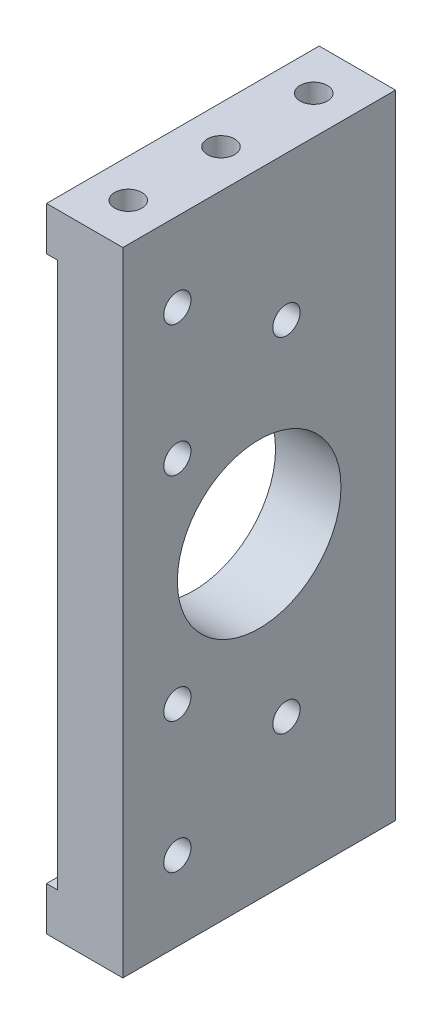
ISO-10303-21;
HEADER;
FILE_DESCRIPTION(('STEP AP214'),'2;1');
FILE_NAME('part.step','',(''),(''),'','','');
FILE_SCHEMA(('AUTOMOTIVE_DESIGN { 1 0 10303 214 1 1 1 1 }'));
ENDSEC;
DATA;
#1=APPLICATION_CONTEXT('core data for automotive mechanical design processes');
#2=APPLICATION_PROTOCOL_DEFINITION('international standard','automotive_design',2000,#1);
#3=PRODUCT_CONTEXT('',#1,'mechanical');
#4=PRODUCT('Part','Part','',(#3));
#5=PRODUCT_RELATED_PRODUCT_CATEGORY('part','',(#4));
#6=PRODUCT_DEFINITION_FORMATION('','',#4);
#7=PRODUCT_DEFINITION_CONTEXT('part definition',#1,'design');
#8=PRODUCT_DEFINITION('design','',#6,#7);
#9=PRODUCT_DEFINITION_SHAPE('','',#8);
#10=(LENGTH_UNIT() NAMED_UNIT(*) SI_UNIT(.MILLI.,.METRE.));
#11=(NAMED_UNIT(*) PLANE_ANGLE_UNIT() SI_UNIT($,.RADIAN.));
#12=(NAMED_UNIT(*) SI_UNIT($,.STERADIAN.) SOLID_ANGLE_UNIT());
#13=UNCERTAINTY_MEASURE_WITH_UNIT(LENGTH_MEASURE(1.E-05),#10,'distance_accuracy_value','');
#14=(GEOMETRIC_REPRESENTATION_CONTEXT(3) GLOBAL_UNCERTAINTY_ASSIGNED_CONTEXT((#13)) GLOBAL_UNIT_ASSIGNED_CONTEXT((#10,
#11,#12)) REPRESENTATION_CONTEXT('',''));
#15=CARTESIAN_POINT('',(0.,0.,0.));
#16=DIRECTION('',(0.,0.,1.));
#17=DIRECTION('',(1.,0.,0.));
#18=AXIS2_PLACEMENT_3D('',#15,#16,#17);
#19=CARTESIAN_POINT('',(0.,0.,25.));
#20=DIRECTION('',(0.,0.,-1.));
#21=DIRECTION('',(-1.,0.,0.));
#22=AXIS2_PLACEMENT_3D('',#19,#20,#21);
#23=PLANE('',#22);
#24=DIRECTION('',(0.,-1.,0.));
#25=VECTOR('',#24,1.);
#26=CARTESIAN_POINT('',(-86.,-29.,25.));
#27=LINE('',#26,#25);
#28=CARTESIAN_POINT('',(-86.,-25.,25.));
#29=VERTEX_POINT('',#28);
#30=CARTESIAN_POINT('',(-86.,-29.,25.));
#31=VERTEX_POINT('',#30);
#32=EDGE_CURVE('E294',#29,#31,#27,.T.);
#33=ORIENTED_EDGE('',*,*,#32,.T.);
#34=DIRECTION('',(-1.,0.,0.));
#35=VECTOR('',#34,1.);
#36=CARTESIAN_POINT('',(-79.,-29.,25.));
#37=LINE('',#36,#35);
#38=CARTESIAN_POINT('',(-79.,-29.,25.));
#39=VERTEX_POINT('',#38);
#40=EDGE_CURVE('E225',#39,#31,#37,.T.);
#41=ORIENTED_EDGE('',*,*,#40,.F.);
#42=DIRECTION('',(0.,1.,0.));
#43=VECTOR('',#42,1.);
#44=CARTESIAN_POINT('',(-79.,-29.,25.));
#45=LINE('',#44,#43);
#46=CARTESIAN_POINT('',(-79.,29.,25.));
#47=VERTEX_POINT('',#46);
#48=EDGE_CURVE('E246',#39,#47,#45,.T.);
#49=ORIENTED_EDGE('',*,*,#48,.T.);
#50=DIRECTION('',(-1.,0.,0.));
#51=VECTOR('',#50,1.);
#52=CARTESIAN_POINT('',(-86.,29.,25.));
#53=LINE('',#52,#51);
#54=CARTESIAN_POINT('',(-86.,29.,25.));
#55=VERTEX_POINT('',#54);
#56=EDGE_CURVE('E50',#47,#55,#53,.T.);
#57=ORIENTED_EDGE('',*,*,#56,.T.);
#58=CARTESIAN_POINT('',(-86.,25.,25.));
#59=VERTEX_POINT('',#58);
#60=EDGE_CURVE('E290',#55,#59,#27,.T.);
#61=ORIENTED_EDGE('',*,*,#60,.T.);
#62=DIRECTION('',(-1.,0.,0.));
#63=VECTOR('',#62,1.);
#64=CARTESIAN_POINT('',(-86.,25.,25.));
#65=LINE('',#64,#63);
#66=CARTESIAN_POINT('',(-85.,25.,25.));
#67=VERTEX_POINT('',#66);
#68=EDGE_CURVE('E260',#67,#59,#65,.T.);
#69=ORIENTED_EDGE('',*,*,#68,.F.);
#70=DIRECTION('',(0.,1.,0.));
#71=VECTOR('',#70,1.);
#72=CARTESIAN_POINT('',(-85.,25.,25.));
#73=LINE('',#72,#71);
#74=CARTESIAN_POINT('',(-85.,-25.,25.));
#75=VERTEX_POINT('',#74);
#76=EDGE_CURVE('E271',#75,#67,#73,.T.);
#77=ORIENTED_EDGE('',*,*,#76,.F.);
#78=DIRECTION('',(1.,0.,0.));
#79=VECTOR('',#78,1.);
#80=CARTESIAN_POINT('',(-86.,-25.,25.));
#81=LINE('',#80,#79);
#82=EDGE_CURVE('E253',#29,#75,#81,.T.);
#83=ORIENTED_EDGE('',*,*,#82,.F.);
#84=EDGE_LOOP('',(#33,#41,#49,#57,#61,#69,#77,#83));
#85=FACE_BOUND('',#84,.T.);
#86=ADVANCED_FACE('F40',(#85),#23,.F.);
#87=CARTESIAN_POINT('',(0.,0.,0.));
#88=DIRECTION('',(0.,0.,-1.));
#89=DIRECTION('',(-1.,0.,0.));
#90=AXIS2_PLACEMENT_3D('',#87,#88,#89);
#91=PLANE('',#90);
#92=DIRECTION('',(1.,0.,0.));
#93=VECTOR('',#92,1.);
#94=CARTESIAN_POINT('',(0.,-29.,0.));
#95=LINE('',#94,#93);
#96=CARTESIAN_POINT('',(-86.,-29.,0.));
#97=VERTEX_POINT('',#96);
#98=CARTESIAN_POINT('',(-79.,-29.,0.));
#99=VERTEX_POINT('',#98);
#100=EDGE_CURVE('E57',#97,#99,#95,.T.);
#101=ORIENTED_EDGE('',*,*,#100,.F.);
#102=DIRECTION('',(0.,-1.,0.));
#103=VECTOR('',#102,1.);
#104=CARTESIAN_POINT('',(-86.,-29.,0.));
#105=LINE('',#104,#103);
#106=CARTESIAN_POINT('',(-86.,-25.,0.));
#107=VERTEX_POINT('',#106);
#108=EDGE_CURVE('E281',#107,#97,#105,.T.);
#109=ORIENTED_EDGE('',*,*,#108,.F.);
#110=DIRECTION('',(1.,0.,0.));
#111=VECTOR('',#110,1.);
#112=CARTESIAN_POINT('',(-86.,-25.,0.));
#113=LINE('',#112,#111);
#114=CARTESIAN_POINT('',(-85.,-25.,0.));
#115=VERTEX_POINT('',#114);
#116=EDGE_CURVE('E256',#107,#115,#113,.T.);
#117=ORIENTED_EDGE('',*,*,#116,.T.);
#118=DIRECTION('',(0.,1.,0.));
#119=VECTOR('',#118,1.);
#120=CARTESIAN_POINT('',(-85.,25.,0.));
#121=LINE('',#120,#119);
#122=CARTESIAN_POINT('',(-85.,25.,0.));
#123=VERTEX_POINT('',#122);
#124=EDGE_CURVE('E65',#115,#123,#121,.T.);
#125=ORIENTED_EDGE('',*,*,#124,.T.);
#126=DIRECTION('',(-1.,0.,0.));
#127=VECTOR('',#126,1.);
#128=CARTESIAN_POINT('',(-86.,25.,0.));
#129=LINE('',#128,#127);
#130=CARTESIAN_POINT('',(-86.,25.,0.));
#131=VERTEX_POINT('',#130);
#132=EDGE_CURVE('E263',#123,#131,#129,.T.);
#133=ORIENTED_EDGE('',*,*,#132,.T.);
#134=CARTESIAN_POINT('',(-86.,29.,0.));
#135=VERTEX_POINT('',#134);
#136=EDGE_CURVE('E297',#135,#131,#105,.T.);
#137=ORIENTED_EDGE('',*,*,#136,.F.);
#138=DIRECTION('',(-1.,0.,0.));
#139=VECTOR('',#138,1.);
#140=CARTESIAN_POINT('',(-86.,29.,0.));
#141=LINE('',#140,#139);
#142=CARTESIAN_POINT('',(-79.,29.,0.));
#143=VERTEX_POINT('',#142);
#144=EDGE_CURVE('E301',#143,#135,#141,.T.);
#145=ORIENTED_EDGE('',*,*,#144,.F.);
#146=DIRECTION('',(0.,1.,0.));
#147=VECTOR('',#146,1.);
#148=CARTESIAN_POINT('',(-79.,-29.,0.));
#149=LINE('',#148,#147);
#150=EDGE_CURVE('E250',#99,#143,#149,.T.);
#151=ORIENTED_EDGE('',*,*,#150,.F.);
#152=EDGE_LOOP('',(#101,#109,#117,#125,#133,#137,#145,#151));
#153=FACE_BOUND('',#152,.T.);
#154=ADVANCED_FACE('F321',(#153),#91,.T.);
#155=CARTESIAN_POINT('',(-86.,-29.,25.));
#156=DIRECTION('',(1.,0.,0.));
#157=DIRECTION('',(0.,0.,-1.));
#158=AXIS2_PLACEMENT_3D('',#155,#156,#157);
#159=PLANE('',#158);
#160=ORIENTED_EDGE('',*,*,#136,.T.);
#161=DIRECTION('',(0.,0.,1.));
#162=VECTOR('',#161,1.);
#163=CARTESIAN_POINT('',(-86.,25.,0.));
#164=LINE('',#163,#162);
#165=EDGE_CURVE('E277',#131,#59,#164,.T.);
#166=ORIENTED_EDGE('',*,*,#165,.T.);
#167=ORIENTED_EDGE('',*,*,#60,.F.);
#168=DIRECTION('',(0.,0.,-1.));
#169=VECTOR('',#168,1.);
#170=CARTESIAN_POINT('',(-86.,29.,25.));
#171=LINE('',#170,#169);
#172=EDGE_CURVE('E11',#55,#135,#171,.T.);
#173=ORIENTED_EDGE('',*,*,#172,.T.);
#174=EDGE_LOOP('',(#160,#166,#167,#173));
#175=FACE_BOUND('',#174,.T.);
#176=ADVANCED_FACE('F331',(#175),#159,.F.);
#177=ORIENTED_EDGE('',*,*,#108,.T.);
#178=DIRECTION('',(0.,0.,1.));
#179=VECTOR('',#178,1.);
#180=CARTESIAN_POINT('',(-86.,-29.,-35.));
#181=LINE('',#180,#179);
#182=EDGE_CURVE('E228',#97,#31,#181,.T.);
#183=ORIENTED_EDGE('',*,*,#182,.T.);
#184=ORIENTED_EDGE('',*,*,#32,.F.);
#185=DIRECTION('',(0.,0.,1.));
#186=VECTOR('',#185,1.);
#187=CARTESIAN_POINT('',(-86.,-25.,0.));
#188=LINE('',#187,#186);
#189=EDGE_CURVE('E267',#107,#29,#188,.T.);
#190=ORIENTED_EDGE('',*,*,#189,.F.);
#191=EDGE_LOOP('',(#177,#183,#184,#190));
#192=FACE_BOUND('',#191,.T.);
#193=ADVANCED_FACE('F42',(#192),#159,.F.);
#194=CARTESIAN_POINT('',(-86.,29.,25.));
#195=DIRECTION('',(0.,-1.,0.));
#196=DIRECTION('',(1.,0.,0.));
#197=AXIS2_PLACEMENT_3D('',#194,#195,#196);
#198=PLANE('',#197);
#199=CARTESIAN_POINT('',(-82.5,29.,21.));
#200=DIRECTION('',(0.,1.,0.));
#201=DIRECTION('',(0.,0.,1.));
#202=AXIS2_PLACEMENT_3D('',#199,#200,#201);
#203=CIRCLE('',#202,1.24999999999999);
#204=CARTESIAN_POINT('',(-82.5,29.,22.25));
#205=VERTEX_POINT('',#204);
#206=EDGE_CURVE('E158',#205,#205,#203,.T.);
#207=ORIENTED_EDGE('',*,*,#206,.F.);
#208=EDGE_LOOP('',(#207));
#209=FACE_BOUND('',#208,.T.);
#210=CARTESIAN_POINT('',(-82.5,29.,12.5));
#211=DIRECTION('',(0.,1.,0.));
#212=DIRECTION('',(0.,0.,1.));
#213=AXIS2_PLACEMENT_3D('',#210,#211,#212);
#214=CIRCLE('',#213,1.24999999999999);
#215=CARTESIAN_POINT('',(-82.5,29.,13.75));
#216=VERTEX_POINT('',#215);
#217=EDGE_CURVE('E166',#216,#216,#214,.T.);
#218=ORIENTED_EDGE('',*,*,#217,.F.);
#219=EDGE_LOOP('',(#218));
#220=FACE_BOUND('',#219,.T.);
#221=CARTESIAN_POINT('',(-82.5,29.,4.));
#222=DIRECTION('',(0.,1.,0.));
#223=DIRECTION('',(0.,0.,1.));
#224=AXIS2_PLACEMENT_3D('',#221,#222,#223);
#225=CIRCLE('',#224,1.24999999999999);
#226=CARTESIAN_POINT('',(-82.5,29.,5.24999999999999));
#227=VERTEX_POINT('',#226);
#228=EDGE_CURVE('E173',#227,#227,#225,.T.);
#229=ORIENTED_EDGE('',*,*,#228,.F.);
#230=EDGE_LOOP('',(#229));
#231=FACE_BOUND('',#230,.T.);
#232=ORIENTED_EDGE('',*,*,#144,.T.);
#233=ORIENTED_EDGE('',*,*,#172,.F.);
#234=ORIENTED_EDGE('',*,*,#56,.F.);
#235=DIRECTION('',(0.,0.,-1.));
#236=VECTOR('',#235,1.);
#237=CARTESIAN_POINT('',(-79.,29.,30.3851648071345));
#238=LINE('',#237,#236);
#239=EDGE_CURVE('E239',#47,#143,#238,.T.);
#240=ORIENTED_EDGE('',*,*,#239,.T.);
#241=EDGE_LOOP('',(#232,#233,#234,#240));
#242=FACE_BOUND('',#241,.T.);
#243=ADVANCED_FACE('F328',(#209,#220,#231,#242),#198,.F.);
#244=CARTESIAN_POINT('',(-86.,25.,0.));
#245=DIRECTION('',(0.,1.,0.));
#246=DIRECTION('',(0.,0.,1.));
#247=AXIS2_PLACEMENT_3D('',#244,#245,#246);
#248=PLANE('',#247);
#249=ORIENTED_EDGE('',*,*,#68,.T.);
#250=ORIENTED_EDGE('',*,*,#165,.F.);
#251=ORIENTED_EDGE('',*,*,#132,.F.);
#252=DIRECTION('',(0.,0.,1.));
#253=VECTOR('',#252,1.);
#254=CARTESIAN_POINT('',(-85.,25.,0.));
#255=LINE('',#254,#253);
#256=EDGE_CURVE('E282',#123,#67,#255,.T.);
#257=ORIENTED_EDGE('',*,*,#256,.T.);
#258=EDGE_LOOP('',(#249,#250,#251,#257));
#259=FACE_BOUND('',#258,.T.);
#260=ADVANCED_FACE('F334',(#259),#248,.F.);
#261=CARTESIAN_POINT('',(-85.,25.,0.));
#262=DIRECTION('',(1.,0.,0.));
#263=DIRECTION('',(0.,0.,-1.));
#264=AXIS2_PLACEMENT_3D('',#261,#262,#263);
#265=PLANE('',#264);
#266=CARTESIAN_POINT('',(-85.,21.75,20.));
#267=DIRECTION('',(-1.,0.,0.));
#268=DIRECTION('',(0.,0.,1.));
#269=AXIS2_PLACEMENT_3D('',#266,#267,#268);
#270=CIRCLE('',#269,1.24999999999999);
#271=CARTESIAN_POINT('',(-85.,21.75,21.25));
#272=VERTEX_POINT('',#271);
#273=EDGE_CURVE('E181',#272,#272,#270,.T.);
#274=ORIENTED_EDGE('',*,*,#273,.F.);
#275=EDGE_LOOP('',(#274));
#276=FACE_BOUND('',#275,.T.);
#277=CARTESIAN_POINT('',(-85.,9.74999999999999,20.));
#278=DIRECTION('',(-1.,0.,0.));
#279=DIRECTION('',(0.,0.,1.));
#280=AXIS2_PLACEMENT_3D('',#277,#278,#279);
#281=CIRCLE('',#280,1.24999999999999);
#282=CARTESIAN_POINT('',(-85.,9.74999999999999,21.25));
#283=VERTEX_POINT('',#282);
#284=EDGE_CURVE('E189',#283,#283,#281,.T.);
#285=ORIENTED_EDGE('',*,*,#284,.F.);
#286=EDGE_LOOP('',(#285));
#287=FACE_BOUND('',#286,.T.);
#288=CARTESIAN_POINT('',(-85.,15.75,10.));
#289=DIRECTION('',(-1.,0.,0.));
#290=DIRECTION('',(0.,0.,1.));
#291=AXIS2_PLACEMENT_3D('',#288,#289,#290);
#292=CIRCLE('',#291,1.24999999999999);
#293=CARTESIAN_POINT('',(-85.,15.75,11.25));
#294=VERTEX_POINT('',#293);
#295=EDGE_CURVE('E197',#294,#294,#292,.T.);
#296=ORIENTED_EDGE('',*,*,#295,.F.);
#297=EDGE_LOOP('',(#296));
#298=FACE_BOUND('',#297,.T.);
#299=CARTESIAN_POINT('',(-85.,-9.75000000000001,20.));
#300=DIRECTION('',(-1.,0.,0.));
#301=DIRECTION('',(0.,0.,1.));
#302=AXIS2_PLACEMENT_3D('',#299,#300,#301);
#303=CIRCLE('',#302,1.24999999999999);
#304=CARTESIAN_POINT('',(-85.,-9.75000000000001,21.25));
#305=VERTEX_POINT('',#304);
#306=EDGE_CURVE('E205',#305,#305,#303,.T.);
#307=ORIENTED_EDGE('',*,*,#306,.F.);
#308=EDGE_LOOP('',(#307));
#309=FACE_BOUND('',#308,.T.);
#310=CARTESIAN_POINT('',(-85.,-21.75,20.));
#311=DIRECTION('',(-1.,0.,0.));
#312=DIRECTION('',(0.,0.,1.));
#313=AXIS2_PLACEMENT_3D('',#310,#311,#312);
#314=CIRCLE('',#313,1.24999999999999);
#315=CARTESIAN_POINT('',(-85.,-21.75,21.25));
#316=VERTEX_POINT('',#315);
#317=EDGE_CURVE('E209',#316,#316,#314,.T.);
#318=ORIENTED_EDGE('',*,*,#317,.F.);
#319=EDGE_LOOP('',(#318));
#320=FACE_BOUND('',#319,.T.);
#321=CARTESIAN_POINT('',(-85.,-15.75,10.));
#322=DIRECTION('',(-1.,0.,0.));
#323=DIRECTION('',(0.,0.,1.));
#324=AXIS2_PLACEMENT_3D('',#321,#322,#323);
#325=CIRCLE('',#324,1.24999999999999);
#326=CARTESIAN_POINT('',(-85.,-15.75,11.25));
#327=VERTEX_POINT('',#326);
#328=EDGE_CURVE('E217',#327,#327,#325,.T.);
#329=ORIENTED_EDGE('',*,*,#328,.F.);
#330=EDGE_LOOP('',(#329));
#331=FACE_BOUND('',#330,.T.);
#332=CARTESIAN_POINT('',(-85.,0.,12.5));
#333=DIRECTION('',(-1.,0.,0.));
#334=DIRECTION('',(0.,0.,1.));
#335=AXIS2_PLACEMENT_3D('',#332,#333,#334);
#336=CIRCLE('',#335,7.5);
#337=CARTESIAN_POINT('',(-85.,0.,20.));
#338=VERTEX_POINT('',#337);
#339=EDGE_CURVE('E235',#338,#338,#336,.T.);
#340=ORIENTED_EDGE('',*,*,#339,.F.);
#341=EDGE_LOOP('',(#340));
#342=FACE_BOUND('',#341,.T.);
#343=ORIENTED_EDGE('',*,*,#76,.T.);
#344=ORIENTED_EDGE('',*,*,#256,.F.);
#345=ORIENTED_EDGE('',*,*,#124,.F.);
#346=DIRECTION('',(0.,0.,1.));
#347=VECTOR('',#346,1.);
#348=CARTESIAN_POINT('',(-85.,-25.,0.));
#349=LINE('',#348,#347);
#350=EDGE_CURVE('E285',#115,#75,#349,.T.);
#351=ORIENTED_EDGE('',*,*,#350,.T.);
#352=EDGE_LOOP('',(#343,#344,#345,#351));
#353=FACE_BOUND('',#352,.T.);
#354=ADVANCED_FACE('F336',(#276,#287,#298,#309,#320,#331,#342,#353),#265,.F.);
#355=CARTESIAN_POINT('',(-86.,-25.,0.));
#356=DIRECTION('',(0.,-1.,0.));
#357=DIRECTION('',(0.,0.,-1.));
#358=AXIS2_PLACEMENT_3D('',#355,#356,#357);
#359=PLANE('',#358);
#360=ORIENTED_EDGE('',*,*,#82,.T.);
#361=ORIENTED_EDGE('',*,*,#350,.F.);
#362=ORIENTED_EDGE('',*,*,#116,.F.);
#363=ORIENTED_EDGE('',*,*,#189,.T.);
#364=EDGE_LOOP('',(#360,#361,#362,#363));
#365=FACE_BOUND('',#364,.T.);
#366=ADVANCED_FACE('F338',(#365),#359,.F.);
#367=CARTESIAN_POINT('',(-79.,-29.,-2.23606797749979));
#368=DIRECTION('',(1.,0.,0.));
#369=DIRECTION('',(0.,0.,-1.));
#370=AXIS2_PLACEMENT_3D('',#367,#368,#369);
#371=PLANE('',#370);
#372=CARTESIAN_POINT('',(-79.,21.75,20.));
#373=DIRECTION('',(1.,0.,0.));
#374=DIRECTION('',(0.,0.,-1.));
#375=AXIS2_PLACEMENT_3D('',#372,#373,#374);
#376=CIRCLE('',#375,1.24999999999999);
#377=CARTESIAN_POINT('',(-79.,21.75,18.75));
#378=VERTEX_POINT('',#377);
#379=EDGE_CURVE('E185',#378,#378,#376,.T.);
#380=ORIENTED_EDGE('',*,*,#379,.F.);
#381=EDGE_LOOP('',(#380));
#382=FACE_BOUND('',#381,.T.);
#383=CARTESIAN_POINT('',(-79.,9.74999999999999,20.));
#384=DIRECTION('',(1.,0.,0.));
#385=DIRECTION('',(0.,0.,-1.));
#386=AXIS2_PLACEMENT_3D('',#383,#384,#385);
#387=CIRCLE('',#386,1.24999999999999);
#388=CARTESIAN_POINT('',(-79.,9.74999999999999,18.75));
#389=VERTEX_POINT('',#388);
#390=EDGE_CURVE('E193',#389,#389,#387,.T.);
#391=ORIENTED_EDGE('',*,*,#390,.F.);
#392=EDGE_LOOP('',(#391));
#393=FACE_BOUND('',#392,.T.);
#394=CARTESIAN_POINT('',(-79.,15.75,10.));
#395=DIRECTION('',(1.,0.,0.));
#396=DIRECTION('',(0.,0.,-1.));
#397=AXIS2_PLACEMENT_3D('',#394,#395,#396);
#398=CIRCLE('',#397,1.24999999999999);
#399=CARTESIAN_POINT('',(-79.,15.75,8.75000000000002));
#400=VERTEX_POINT('',#399);
#401=EDGE_CURVE('E201',#400,#400,#398,.T.);
#402=ORIENTED_EDGE('',*,*,#401,.F.);
#403=EDGE_LOOP('',(#402));
#404=FACE_BOUND('',#403,.T.);
#405=CARTESIAN_POINT('',(-79.,-9.75000000000001,20.));
#406=DIRECTION('',(1.,0.,0.));
#407=DIRECTION('',(0.,0.,-1.));
#408=AXIS2_PLACEMENT_3D('',#405,#406,#407);
#409=CIRCLE('',#408,1.24999999999999);
#410=CARTESIAN_POINT('',(-79.,-9.75000000000001,18.75));
#411=VERTEX_POINT('',#410);
#412=EDGE_CURVE('E44',#411,#411,#409,.T.);
#413=ORIENTED_EDGE('',*,*,#412,.F.);
#414=EDGE_LOOP('',(#413));
#415=FACE_BOUND('',#414,.T.);
#416=CARTESIAN_POINT('',(-79.,-21.75,20.));
#417=DIRECTION('',(1.,0.,0.));
#418=DIRECTION('',(0.,0.,-1.));
#419=AXIS2_PLACEMENT_3D('',#416,#417,#418);
#420=CIRCLE('',#419,1.24999999999999);
#421=CARTESIAN_POINT('',(-79.,-21.75,18.75));
#422=VERTEX_POINT('',#421);
#423=EDGE_CURVE('E213',#422,#422,#420,.T.);
#424=ORIENTED_EDGE('',*,*,#423,.F.);
#425=EDGE_LOOP('',(#424));
#426=FACE_BOUND('',#425,.T.);
#427=CARTESIAN_POINT('',(-79.,-15.75,10.));
#428=DIRECTION('',(1.,0.,0.));
#429=DIRECTION('',(0.,0.,-1.));
#430=AXIS2_PLACEMENT_3D('',#427,#428,#429);
#431=CIRCLE('',#430,1.24999999999999);
#432=CARTESIAN_POINT('',(-79.,-15.75,8.75000000000002));
#433=VERTEX_POINT('',#432);
#434=EDGE_CURVE('E221',#433,#433,#431,.T.);
#435=ORIENTED_EDGE('',*,*,#434,.F.);
#436=EDGE_LOOP('',(#435));
#437=FACE_BOUND('',#436,.T.);
#438=ORIENTED_EDGE('',*,*,#239,.F.);
#439=ORIENTED_EDGE('',*,*,#48,.F.);
#440=DIRECTION('',(0.,0.,1.));
#441=VECTOR('',#440,1.);
#442=CARTESIAN_POINT('',(-79.,-29.,-2.23606797749979));
#443=LINE('',#442,#441);
#444=EDGE_CURVE('E249',#99,#39,#443,.T.);
#445=ORIENTED_EDGE('',*,*,#444,.F.);
#446=ORIENTED_EDGE('',*,*,#150,.T.);
#447=EDGE_LOOP('',(#438,#439,#445,#446));
#448=FACE_BOUND('',#447,.T.);
#449=CARTESIAN_POINT('',(-79.,0.,12.5));
#450=DIRECTION('',(1.,0.,0.));
#451=DIRECTION('',(0.,0.,-1.));
#452=AXIS2_PLACEMENT_3D('',#449,#450,#451);
#453=CIRCLE('',#452,7.5);
#454=CARTESIAN_POINT('',(-79.,0.,5.));
#455=VERTEX_POINT('',#454);
#456=EDGE_CURVE('E234',#455,#455,#453,.F.);
#457=ORIENTED_EDGE('',*,*,#456,.T.);
#458=EDGE_LOOP('',(#457));
#459=FACE_BOUND('',#458,.T.);
#460=ADVANCED_FACE('F325',(#382,#393,#404,#415,#426,#437,#448,#459),#371,.T.);
#461=CARTESIAN_POINT('',(86.001,0.,12.5));
#462=DIRECTION('',(-1.,0.,0.));
#463=DIRECTION('',(0.,0.,1.));
#464=AXIS2_PLACEMENT_3D('',#461,#462,#463);
#465=CYLINDRICAL_SURFACE('',#464,7.5);
#466=ORIENTED_EDGE('',*,*,#456,.F.);
#467=EDGE_LOOP('',(#466));
#468=FACE_BOUND('',#467,.T.);
#469=ORIENTED_EDGE('',*,*,#339,.T.);
#470=EDGE_LOOP('',(#469));
#471=FACE_BOUND('',#470,.T.);
#472=ADVANCED_FACE('F345',(#468,#471),#465,.F.);
#473=CARTESIAN_POINT('',(-79.,-29.,-35.));
#474=DIRECTION('',(0.,1.,0.));
#475=DIRECTION('',(0.,0.,1.));
#476=AXIS2_PLACEMENT_3D('',#473,#474,#475);
#477=PLANE('',#476);
#478=CARTESIAN_POINT('',(-82.5,-29.0000000000001,21.));
#479=DIRECTION('',(0.,-1.,0.));
#480=DIRECTION('',(0.,0.,-1.));
#481=AXIS2_PLACEMENT_3D('',#478,#479,#480);
#482=CIRCLE('',#481,1.24999999999999);
#483=CARTESIAN_POINT('',(-82.5,-29.0000000000001,19.75));
#484=VERTEX_POINT('',#483);
#485=EDGE_CURVE('E135',#484,#484,#482,.T.);
#486=ORIENTED_EDGE('',*,*,#485,.F.);
#487=EDGE_LOOP('',(#486));
#488=FACE_BOUND('',#487,.T.);
#489=CARTESIAN_POINT('',(-82.5,-29.0000000000001,12.5));
#490=DIRECTION('',(0.,-1.,0.));
#491=DIRECTION('',(0.,0.,-1.));
#492=AXIS2_PLACEMENT_3D('',#489,#490,#491);
#493=CIRCLE('',#492,1.24999999999999);
#494=CARTESIAN_POINT('',(-82.5,-29.0000000000001,11.25));
#495=VERTEX_POINT('',#494);
#496=EDGE_CURVE('E134',#495,#495,#493,.T.);
#497=ORIENTED_EDGE('',*,*,#496,.F.);
#498=EDGE_LOOP('',(#497));
#499=FACE_BOUND('',#498,.T.);
#500=CARTESIAN_POINT('',(-82.5,-29.0000000000001,4.));
#501=DIRECTION('',(0.,-1.,0.));
#502=DIRECTION('',(0.,0.,-1.));
#503=AXIS2_PLACEMENT_3D('',#500,#501,#502);
#504=CIRCLE('',#503,1.24999999999999);
#505=CARTESIAN_POINT('',(-82.5,-29.0000000000001,2.75000000000001));
#506=VERTEX_POINT('',#505);
#507=EDGE_CURVE('E150',#506,#506,#504,.T.);
#508=ORIENTED_EDGE('',*,*,#507,.F.);
#509=EDGE_LOOP('',(#508));
#510=FACE_BOUND('',#509,.T.);
#511=ORIENTED_EDGE('',*,*,#100,.T.);
#512=ORIENTED_EDGE('',*,*,#444,.T.);
#513=ORIENTED_EDGE('',*,*,#40,.T.);
#514=ORIENTED_EDGE('',*,*,#182,.F.);
#515=EDGE_LOOP('',(#511,#512,#513,#514));
#516=FACE_BOUND('',#515,.T.);
#517=ADVANCED_FACE('F319',(#488,#499,#510,#516),#477,.F.);
#518=CARTESIAN_POINT('',(-85.,-15.75,10.));
#519=DIRECTION('',(-1.,0.,0.));
#520=DIRECTION('',(0.,0.,1.));
#521=AXIS2_PLACEMENT_3D('',#518,#519,#520);
#522=CYLINDRICAL_SURFACE('',#521,1.24999999999999);
#523=ORIENTED_EDGE('',*,*,#434,.T.);
#524=EDGE_LOOP('',(#523));
#525=FACE_BOUND('',#524,.T.);
#526=ORIENTED_EDGE('',*,*,#328,.T.);
#527=EDGE_LOOP('',(#526));
#528=FACE_BOUND('',#527,.T.);
#529=ADVANCED_FACE('F406',(#525,#528),#522,.F.);
#530=CARTESIAN_POINT('',(-85.,-21.75,20.));
#531=DIRECTION('',(-1.,0.,0.));
#532=DIRECTION('',(0.,0.,1.));
#533=AXIS2_PLACEMENT_3D('',#530,#531,#532);
#534=CYLINDRICAL_SURFACE('',#533,1.24999999999999);
#535=ORIENTED_EDGE('',*,*,#423,.T.);
#536=EDGE_LOOP('',(#535));
#537=FACE_BOUND('',#536,.T.);
#538=ORIENTED_EDGE('',*,*,#317,.T.);
#539=EDGE_LOOP('',(#538));
#540=FACE_BOUND('',#539,.T.);
#541=ADVANCED_FACE('F402',(#537,#540),#534,.F.);
#542=CARTESIAN_POINT('',(-85.,-9.75000000000001,20.));
#543=DIRECTION('',(-1.,0.,0.));
#544=DIRECTION('',(0.,0.,1.));
#545=AXIS2_PLACEMENT_3D('',#542,#543,#544);
#546=CYLINDRICAL_SURFACE('',#545,1.24999999999999);
#547=ORIENTED_EDGE('',*,*,#412,.T.);
#548=EDGE_LOOP('',(#547));
#549=FACE_BOUND('',#548,.T.);
#550=ORIENTED_EDGE('',*,*,#306,.T.);
#551=EDGE_LOOP('',(#550));
#552=FACE_BOUND('',#551,.T.);
#553=ADVANCED_FACE('F398',(#549,#552),#546,.F.);
#554=CARTESIAN_POINT('',(-85.,15.75,10.));
#555=DIRECTION('',(-1.,0.,0.));
#556=DIRECTION('',(0.,0.,1.));
#557=AXIS2_PLACEMENT_3D('',#554,#555,#556);
#558=CYLINDRICAL_SURFACE('',#557,1.24999999999999);
#559=ORIENTED_EDGE('',*,*,#401,.T.);
#560=EDGE_LOOP('',(#559));
#561=FACE_BOUND('',#560,.T.);
#562=ORIENTED_EDGE('',*,*,#295,.T.);
#563=EDGE_LOOP('',(#562));
#564=FACE_BOUND('',#563,.T.);
#565=ADVANCED_FACE('F394',(#561,#564),#558,.F.);
#566=CARTESIAN_POINT('',(-85.,9.74999999999999,20.));
#567=DIRECTION('',(-1.,0.,0.));
#568=DIRECTION('',(0.,0.,1.));
#569=AXIS2_PLACEMENT_3D('',#566,#567,#568);
#570=CYLINDRICAL_SURFACE('',#569,1.24999999999999);
#571=ORIENTED_EDGE('',*,*,#390,.T.);
#572=EDGE_LOOP('',(#571));
#573=FACE_BOUND('',#572,.T.);
#574=ORIENTED_EDGE('',*,*,#284,.T.);
#575=EDGE_LOOP('',(#574));
#576=FACE_BOUND('',#575,.T.);
#577=ADVANCED_FACE('F390',(#573,#576),#570,.F.);
#578=CARTESIAN_POINT('',(-85.,21.75,20.));
#579=DIRECTION('',(-1.,0.,0.));
#580=DIRECTION('',(0.,0.,1.));
#581=AXIS2_PLACEMENT_3D('',#578,#579,#580);
#582=CYLINDRICAL_SURFACE('',#581,1.24999999999999);
#583=ORIENTED_EDGE('',*,*,#379,.T.);
#584=EDGE_LOOP('',(#583));
#585=FACE_BOUND('',#584,.T.);
#586=ORIENTED_EDGE('',*,*,#273,.T.);
#587=EDGE_LOOP('',(#586));
#588=FACE_BOUND('',#587,.T.);
#589=ADVANCED_FACE('F382',(#585,#588),#582,.F.);
#590=CARTESIAN_POINT('',(-82.5,24.,4.));
#591=DIRECTION('',(0.,1.,0.));
#592=DIRECTION('',(0.,0.,1.));
#593=AXIS2_PLACEMENT_3D('',#590,#591,#592);
#594=CONICAL_SURFACE('',#593,1.25,1.02974425867666);
#595=CARTESIAN_POINT('',(-82.5,23.2489242262155,4.));
#596=VERTEX_POINT('',#595);
#597=VERTEX_LOOP('',#596);
#598=FACE_BOUND('',#597,.T.);
#599=CARTESIAN_POINT('',(-82.5,24.,4.));
#600=DIRECTION('',(0.,1.,0.));
#601=DIRECTION('',(0.,0.,1.));
#602=AXIS2_PLACEMENT_3D('',#599,#600,#601);
#603=CIRCLE('',#602,1.25);
#604=CARTESIAN_POINT('',(-82.5,24.,5.25));
#605=VERTEX_POINT('',#604);
#606=EDGE_CURVE('E177',#605,#605,#603,.T.);
#607=ORIENTED_EDGE('',*,*,#606,.T.);
#608=EDGE_LOOP('',(#607));
#609=FACE_BOUND('',#608,.T.);
#610=ADVANCED_FACE('F372',(#598,#609),#594,.F.);
#611=CARTESIAN_POINT('',(-82.5,29.,4.));
#612=DIRECTION('',(0.,1.,0.));
#613=DIRECTION('',(0.,0.,1.));
#614=AXIS2_PLACEMENT_3D('',#611,#612,#613);
#615=CYLINDRICAL_SURFACE('',#614,1.24999999999999);
#616=ORIENTED_EDGE('',*,*,#606,.F.);
#617=EDGE_LOOP('',(#616));
#618=FACE_BOUND('',#617,.T.);
#619=ORIENTED_EDGE('',*,*,#228,.T.);
#620=EDGE_LOOP('',(#619));
#621=FACE_BOUND('',#620,.T.);
#622=ADVANCED_FACE('F369',(#618,#621),#615,.F.);
#623=CARTESIAN_POINT('',(-82.5,24.,12.5));
#624=DIRECTION('',(0.,1.,0.));
#625=DIRECTION('',(0.,0.,1.));
#626=AXIS2_PLACEMENT_3D('',#623,#624,#625);
#627=CONICAL_SURFACE('',#626,1.25,1.02974425867666);
#628=CARTESIAN_POINT('',(-82.5,23.2489242262155,12.5));
#629=VERTEX_POINT('',#628);
#630=VERTEX_LOOP('',#629);
#631=FACE_BOUND('',#630,.T.);
#632=CARTESIAN_POINT('',(-82.5,24.,12.5));
#633=DIRECTION('',(0.,1.,0.));
#634=DIRECTION('',(0.,0.,1.));
#635=AXIS2_PLACEMENT_3D('',#632,#633,#634);
#636=CIRCLE('',#635,1.25);
#637=CARTESIAN_POINT('',(-82.5,24.,13.75));
#638=VERTEX_POINT('',#637);
#639=EDGE_CURVE('E169',#638,#638,#636,.T.);
#640=ORIENTED_EDGE('',*,*,#639,.T.);
#641=EDGE_LOOP('',(#640));
#642=FACE_BOUND('',#641,.T.);
#643=ADVANCED_FACE('F371',(#631,#642),#627,.F.);
#644=CARTESIAN_POINT('',(-82.5,29.,12.5));
#645=DIRECTION('',(0.,1.,0.));
#646=DIRECTION('',(0.,0.,1.));
#647=AXIS2_PLACEMENT_3D('',#644,#645,#646);
#648=CYLINDRICAL_SURFACE('',#647,1.24999999999999);
#649=ORIENTED_EDGE('',*,*,#639,.F.);
#650=EDGE_LOOP('',(#649));
#651=FACE_BOUND('',#650,.T.);
#652=ORIENTED_EDGE('',*,*,#217,.T.);
#653=EDGE_LOOP('',(#652));
#654=FACE_BOUND('',#653,.T.);
#655=ADVANCED_FACE('F379',(#651,#654),#648,.F.);
#656=CARTESIAN_POINT('',(-82.5,24.,21.));
#657=DIRECTION('',(0.,1.,0.));
#658=DIRECTION('',(0.,0.,1.));
#659=AXIS2_PLACEMENT_3D('',#656,#657,#658);
#660=CONICAL_SURFACE('',#659,1.25,1.02974425867666);
#661=CARTESIAN_POINT('',(-82.5,23.2489242262155,21.));
#662=VERTEX_POINT('',#661);
#663=VERTEX_LOOP('',#662);
#664=FACE_BOUND('',#663,.T.);
#665=CARTESIAN_POINT('',(-82.5,24.,21.));
#666=DIRECTION('',(0.,1.,0.));
#667=DIRECTION('',(0.,0.,1.));
#668=AXIS2_PLACEMENT_3D('',#665,#666,#667);
#669=CIRCLE('',#668,1.25);
#670=CARTESIAN_POINT('',(-82.5,24.,22.25));
#671=VERTEX_POINT('',#670);
#672=EDGE_CURVE('E162',#671,#671,#669,.T.);
#673=ORIENTED_EDGE('',*,*,#672,.T.);
#674=EDGE_LOOP('',(#673));
#675=FACE_BOUND('',#674,.T.);
#676=ADVANCED_FACE('F465',(#664,#675),#660,.F.);
#677=CARTESIAN_POINT('',(-82.5,29.,21.));
#678=DIRECTION('',(0.,1.,0.));
#679=DIRECTION('',(0.,0.,1.));
#680=AXIS2_PLACEMENT_3D('',#677,#678,#679);
#681=CYLINDRICAL_SURFACE('',#680,1.24999999999999);
#682=ORIENTED_EDGE('',*,*,#672,.F.);
#683=EDGE_LOOP('',(#682));
#684=FACE_BOUND('',#683,.T.);
#685=ORIENTED_EDGE('',*,*,#206,.T.);
#686=EDGE_LOOP('',(#685));
#687=FACE_BOUND('',#686,.T.);
#688=ADVANCED_FACE('F473',(#684,#687),#681,.F.);
#689=CARTESIAN_POINT('',(-82.5,-24.0000000000001,4.));
#690=DIRECTION('',(0.,-1.,0.));
#691=DIRECTION('',(0.,0.,-1.));
#692=AXIS2_PLACEMENT_3D('',#689,#690,#691);
#693=CONICAL_SURFACE('',#692,1.25,1.02974425867666);
#694=CARTESIAN_POINT('',(-82.5,-23.2489242262156,4.));
#695=VERTEX_POINT('',#694);
#696=VERTEX_LOOP('',#695);
#697=FACE_BOUND('',#696,.T.);
#698=CARTESIAN_POINT('',(-82.5,-24.0000000000001,4.));
#699=DIRECTION('',(0.,-1.,0.));
#700=DIRECTION('',(0.,0.,-1.));
#701=AXIS2_PLACEMENT_3D('',#698,#699,#700);
#702=CIRCLE('',#701,1.25);
#703=CARTESIAN_POINT('',(-82.5,-24.0000000000001,2.75));
#704=VERTEX_POINT('',#703);
#705=EDGE_CURVE('E154',#704,#704,#702,.T.);
#706=ORIENTED_EDGE('',*,*,#705,.T.);
#707=EDGE_LOOP('',(#706));
#708=FACE_BOUND('',#707,.T.);
#709=ADVANCED_FACE('F482',(#697,#708),#693,.F.);
#710=CARTESIAN_POINT('',(-82.5,-29.0000000000001,4.));
#711=DIRECTION('',(0.,-1.,0.));
#712=DIRECTION('',(0.,0.,-1.));
#713=AXIS2_PLACEMENT_3D('',#710,#711,#712);
#714=CYLINDRICAL_SURFACE('',#713,1.24999999999999);
#715=ORIENTED_EDGE('',*,*,#705,.F.);
#716=EDGE_LOOP('',(#715));
#717=FACE_BOUND('',#716,.T.);
#718=ORIENTED_EDGE('',*,*,#507,.T.);
#719=EDGE_LOOP('',(#718));
#720=FACE_BOUND('',#719,.T.);
#721=ADVANCED_FACE('F491',(#717,#720),#714,.F.);
#722=CARTESIAN_POINT('',(-82.5,-24.0000000000001,12.5));
#723=DIRECTION('',(0.,-1.,0.));
#724=DIRECTION('',(0.,0.,-1.));
#725=AXIS2_PLACEMENT_3D('',#722,#723,#724);
#726=CONICAL_SURFACE('',#725,1.25,1.02974425867666);
#727=CARTESIAN_POINT('',(-82.5,-23.2489242262156,12.5));
#728=VERTEX_POINT('',#727);
#729=VERTEX_LOOP('',#728);
#730=FACE_BOUND('',#729,.T.);
#731=CARTESIAN_POINT('',(-82.5,-24.0000000000001,12.5));
#732=DIRECTION('',(0.,-1.,0.));
#733=DIRECTION('',(0.,0.,-1.));
#734=AXIS2_PLACEMENT_3D('',#731,#732,#733);
#735=CIRCLE('',#734,1.25);
#736=CARTESIAN_POINT('',(-82.5,-24.0000000000001,11.25));
#737=VERTEX_POINT('',#736);
#738=EDGE_CURVE('E141',#737,#737,#735,.T.);
#739=ORIENTED_EDGE('',*,*,#738,.T.);
#740=EDGE_LOOP('',(#739));
#741=FACE_BOUND('',#740,.T.);
#742=ADVANCED_FACE('F500',(#730,#741),#726,.F.);
#743=CARTESIAN_POINT('',(-82.5,-29.0000000000001,12.5));
#744=DIRECTION('',(0.,-1.,0.));
#745=DIRECTION('',(0.,0.,-1.));
#746=AXIS2_PLACEMENT_3D('',#743,#744,#745);
#747=CYLINDRICAL_SURFACE('',#746,1.24999999999999);
#748=ORIENTED_EDGE('',*,*,#738,.F.);
#749=EDGE_LOOP('',(#748));
#750=FACE_BOUND('',#749,.T.);
#751=ORIENTED_EDGE('',*,*,#496,.T.);
#752=EDGE_LOOP('',(#751));
#753=FACE_BOUND('',#752,.T.);
#754=ADVANCED_FACE('F127',(#750,#753),#747,.F.);
#755=CARTESIAN_POINT('',(-82.5,-24.0000000000001,21.));
#756=DIRECTION('',(0.,-1.,0.));
#757=DIRECTION('',(0.,0.,-1.));
#758=AXIS2_PLACEMENT_3D('',#755,#756,#757);
#759=CONICAL_SURFACE('',#758,1.25,1.02974425867666);
#760=CARTESIAN_POINT('',(-82.5,-23.2489242262156,21.));
#761=VERTEX_POINT('',#760);
#762=VERTEX_LOOP('',#761);
#763=FACE_BOUND('',#762,.T.);
#764=CARTESIAN_POINT('',(-82.5,-24.0000000000001,21.));
#765=DIRECTION('',(0.,-1.,0.));
#766=DIRECTION('',(0.,0.,-1.));
#767=AXIS2_PLACEMENT_3D('',#764,#765,#766);
#768=CIRCLE('',#767,1.25);
#769=CARTESIAN_POINT('',(-82.5,-24.0000000000001,19.75));
#770=VERTEX_POINT('',#769);
#771=EDGE_CURVE('E131',#770,#770,#768,.T.);
#772=ORIENTED_EDGE('',*,*,#771,.T.);
#773=EDGE_LOOP('',(#772));
#774=FACE_BOUND('',#773,.T.);
#775=ADVANCED_FACE('F123',(#763,#774),#759,.F.);
#776=CARTESIAN_POINT('',(-82.5,-29.0000000000001,21.));
#777=DIRECTION('',(0.,-1.,0.));
#778=DIRECTION('',(0.,0.,-1.));
#779=AXIS2_PLACEMENT_3D('',#776,#777,#778);
#780=CYLINDRICAL_SURFACE('',#779,1.24999999999999);
#781=ORIENTED_EDGE('',*,*,#771,.F.);
#782=EDGE_LOOP('',(#781));
#783=FACE_BOUND('',#782,.T.);
#784=ORIENTED_EDGE('',*,*,#485,.T.);
#785=EDGE_LOOP('',(#784));
#786=FACE_BOUND('',#785,.T.);
#787=ADVANCED_FACE('F126',(#783,#786),#780,.F.);
#788=CLOSED_SHELL('',(#86,#154,#176,#193,#243,#260,#354,#366,#460,#472,#517,#529,#541,#553,#565,
#577,#589,#610,#622,#643,#655,#676,#688,#709,#721,#742,#754,#775,#787));
#789=MANIFOLD_SOLID_BREP('B2',#788);
#790=ADVANCED_BREP_SHAPE_REPRESENTATION('',(#18,#789),#14);
#791=SHAPE_DEFINITION_REPRESENTATION(#9,#790);
ENDSEC;
END-ISO-10303-21;
